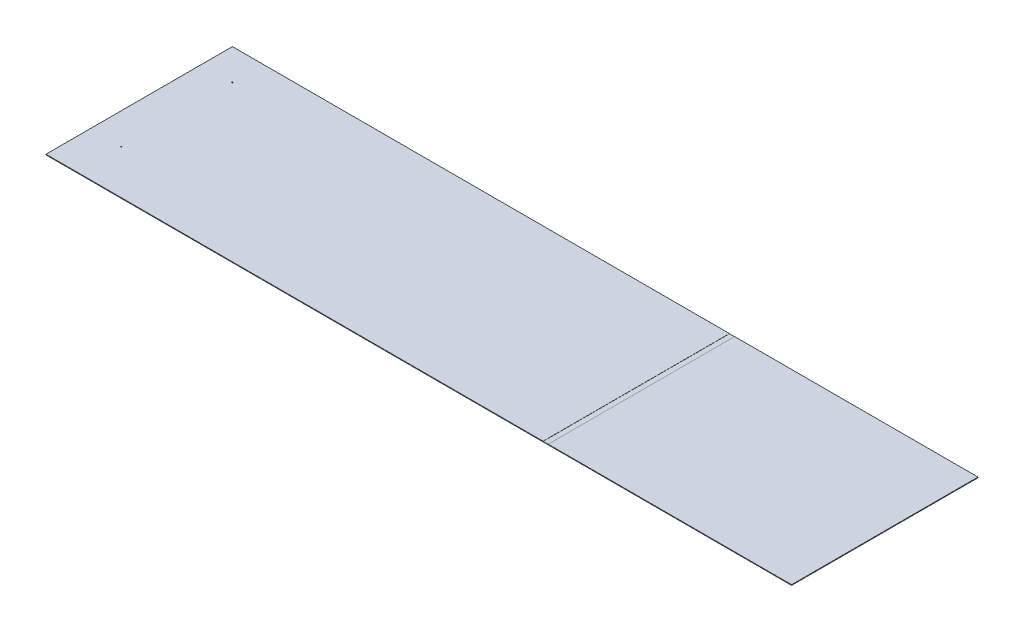
ISO-10303-21;
HEADER;
FILE_DESCRIPTION(('STEP AP214'),'2;1');
FILE_NAME('part.step','',(''),(''),'','','');
FILE_SCHEMA(('AUTOMOTIVE_DESIGN { 1 0 10303 214 1 1 1 1 }'));
ENDSEC;
DATA;
#1=APPLICATION_CONTEXT('core data for automotive mechanical design processes');
#2=APPLICATION_PROTOCOL_DEFINITION('international standard','automotive_design',2000,#1);
#3=PRODUCT_CONTEXT('',#1,'mechanical');
#4=PRODUCT('Part','Part','',(#3));
#5=PRODUCT_RELATED_PRODUCT_CATEGORY('part','',(#4));
#6=PRODUCT_DEFINITION_FORMATION('','',#4);
#7=PRODUCT_DEFINITION_CONTEXT('part definition',#1,'design');
#8=PRODUCT_DEFINITION('design','',#6,#7);
#9=PRODUCT_DEFINITION_SHAPE('','',#8);
#10=(LENGTH_UNIT() NAMED_UNIT(*) SI_UNIT(.MILLI.,.METRE.));
#11=(NAMED_UNIT(*) PLANE_ANGLE_UNIT() SI_UNIT($,.RADIAN.));
#12=(NAMED_UNIT(*) SI_UNIT($,.STERADIAN.) SOLID_ANGLE_UNIT());
#13=UNCERTAINTY_MEASURE_WITH_UNIT(LENGTH_MEASURE(1.E-05),#10,'distance_accuracy_value','');
#14=(GEOMETRIC_REPRESENTATION_CONTEXT(3) GLOBAL_UNCERTAINTY_ASSIGNED_CONTEXT((#13)) GLOBAL_UNIT_ASSIGNED_CONTEXT((#10,
#11,#12)) REPRESENTATION_CONTEXT('',''));
#15=CARTESIAN_POINT('',(0.,0.,0.));
#16=DIRECTION('',(0.,0.,1.));
#17=DIRECTION('',(1.,0.,0.));
#18=AXIS2_PLACEMENT_3D('',#15,#16,#17);
#19=CARTESIAN_POINT('',(0.,3.175,0.));
#20=DIRECTION('',(0.,1.,0.));
#21=DIRECTION('',(0.,0.,1.));
#22=AXIS2_PLACEMENT_3D('',#19,#20,#21);
#23=PLANE('',#22);
#24=DIRECTION('',(0.,0.,1.));
#25=VECTOR('',#24,1.);
#26=CARTESIAN_POINT('',(1029.72013969732,3.175,-803.692665890571));
#27=LINE('',#26,#25);
#28=CARTESIAN_POINT('',(1029.72013969732,3.175,-803.692665890571));
#29=VERTEX_POINT('',#28);
#30=CARTESIAN_POINT('',(1029.72013969732,3.175,110.707334109429));
#31=VERTEX_POINT('',#30);
#32=EDGE_CURVE('E121',#29,#31,#27,.T.);
#33=ORIENTED_EDGE('',*,*,#32,.F.);
#34=DIRECTION('',(-1.,0.,0.));
#35=VECTOR('',#34,1.);
#36=CARTESIAN_POINT('',(-1408.67986030268,3.175,-803.692665890571));
#37=LINE('',#36,#35);
#38=CARTESIAN_POINT('',(-1408.67986030268,3.175,-803.692665890571));
#39=VERTEX_POINT('',#38);
#40=EDGE_CURVE('E66',#29,#39,#37,.T.);
#41=ORIENTED_EDGE('',*,*,#40,.T.);
#42=DIRECTION('',(0.,0.,1.));
#43=VECTOR('',#42,1.);
#44=CARTESIAN_POINT('',(-1408.67986030268,3.175,-803.692665890571));
#45=LINE('',#44,#43);
#46=CARTESIAN_POINT('',(-1408.67986030268,3.175,110.707334109429));
#47=VERTEX_POINT('',#46);
#48=EDGE_CURVE('E176',#39,#47,#45,.T.);
#49=ORIENTED_EDGE('',*,*,#48,.T.);
#50=DIRECTION('',(1.,0.,0.));
#51=VECTOR('',#50,1.);
#52=CARTESIAN_POINT('',(-1408.67986030268,3.175,110.707334109429));
#53=LINE('',#52,#51);
#54=EDGE_CURVE('E95',#47,#31,#53,.T.);
#55=ORIENTED_EDGE('',*,*,#54,.T.);
#56=EDGE_LOOP('',(#33,#41,#49,#55));
#57=FACE_BOUND('',#56,.T.);
#58=CARTESIAN_POINT('',(-1256.27986030268,3.175,-651.292665890571));
#59=DIRECTION('',(0.,1.,0.));
#60=DIRECTION('',(0.,0.,1.));
#61=AXIS2_PLACEMENT_3D('',#58,#59,#60);
#62=CIRCLE('',#61,2.5796874999999);
#63=CARTESIAN_POINT('',(-1256.27986030268,3.175,-648.712978390571));
#64=VERTEX_POINT('',#63);
#65=EDGE_CURVE('E165',#64,#64,#62,.T.);
#66=ORIENTED_EDGE('',*,*,#65,.F.);
#67=EDGE_LOOP('',(#66));
#68=FACE_BOUND('',#67,.T.);
#69=CARTESIAN_POINT('',(-1256.27986030268,3.175,-105.192665890571));
#70=DIRECTION('',(0.,1.,0.));
#71=DIRECTION('',(0.,0.,1.));
#72=AXIS2_PLACEMENT_3D('',#69,#70,#71);
#73=CIRCLE('',#72,2.5796874999999);
#74=CARTESIAN_POINT('',(-1256.27986030268,3.175,-102.612978390571));
#75=VERTEX_POINT('',#74);
#76=EDGE_CURVE('E153',#75,#75,#73,.T.);
#77=ORIENTED_EDGE('',*,*,#76,.F.);
#78=EDGE_LOOP('',(#77));
#79=FACE_BOUND('',#78,.T.);
#80=ADVANCED_FACE('F41',(#57,#68,#79),#23,.T.);
#81=CARTESIAN_POINT('',(-1408.67986030268,3.175,-803.692665890571));
#82=DIRECTION('',(1.,0.,0.));
#83=DIRECTION('',(0.,0.,-1.));
#84=AXIS2_PLACEMENT_3D('',#81,#82,#83);
#85=PLANE('',#84);
#86=DIRECTION('',(0.,0.,1.));
#87=VECTOR('',#86,1.);
#88=CARTESIAN_POINT('',(-1408.67986030268,0.,-803.692665890571));
#89=LINE('',#88,#87);
#90=CARTESIAN_POINT('',(-1408.67986030268,0.,-803.692665890571));
#91=VERTEX_POINT('',#90);
#92=CARTESIAN_POINT('',(-1408.67986030268,0.,110.707334109429));
#93=VERTEX_POINT('',#92);
#94=EDGE_CURVE('E164',#91,#93,#89,.T.);
#95=ORIENTED_EDGE('',*,*,#94,.T.);
#96=DIRECTION('',(0.,-1.,0.));
#97=VECTOR('',#96,1.);
#98=CARTESIAN_POINT('',(-1408.67986030268,3.175,110.707334109429));
#99=LINE('',#98,#97);
#100=EDGE_CURVE('E11',#47,#93,#99,.T.);
#101=ORIENTED_EDGE('',*,*,#100,.F.);
#102=ORIENTED_EDGE('',*,*,#48,.F.);
#103=DIRECTION('',(0.,-1.,0.));
#104=VECTOR('',#103,1.);
#105=CARTESIAN_POINT('',(-1408.67986030268,3.175,-803.692665890571));
#106=LINE('',#105,#104);
#107=EDGE_CURVE('E189',#39,#91,#106,.T.);
#108=ORIENTED_EDGE('',*,*,#107,.T.);
#109=EDGE_LOOP('',(#95,#101,#102,#108));
#110=FACE_BOUND('',#109,.T.);
#111=ADVANCED_FACE('F43',(#110),#85,.F.);
#112=CARTESIAN_POINT('',(-1408.67986030268,3.175,110.707334109429));
#113=DIRECTION('',(0.,0.,-1.));
#114=DIRECTION('',(-1.,0.,0.));
#115=AXIS2_PLACEMENT_3D('',#112,#113,#114);
#116=PLANE('',#115);
#117=DIRECTION('',(1.,0.,0.));
#118=VECTOR('',#117,1.);
#119=CARTESIAN_POINT('',(1029.72013969732,2.38125,110.707334109429));
#120=LINE('',#119,#118);
#121=CARTESIAN_POINT('',(1029.72013969732,2.38125,110.707334109429));
#122=VERTEX_POINT('',#121);
#123=CARTESIAN_POINT('',(1055.12013969732,2.38125,110.707334109429));
#124=VERTEX_POINT('',#123);
#125=EDGE_CURVE('E130',#122,#124,#120,.T.);
#126=ORIENTED_EDGE('',*,*,#125,.F.);
#127=DIRECTION('',(0.,1.,0.));
#128=VECTOR('',#127,1.);
#129=CARTESIAN_POINT('',(1029.72013969732,2.38125,110.707334109429));
#130=LINE('',#129,#128);
#131=EDGE_CURVE('E116',#122,#31,#130,.T.);
#132=ORIENTED_EDGE('',*,*,#131,.T.);
#133=ORIENTED_EDGE('',*,*,#54,.F.);
#134=ORIENTED_EDGE('',*,*,#100,.T.);
#135=DIRECTION('',(1.,0.,0.));
#136=VECTOR('',#135,1.);
#137=CARTESIAN_POINT('',(-1408.67986030268,0.,110.707334109429));
#138=LINE('',#137,#136);
#139=CARTESIAN_POINT('',(2248.92013969732,0.,110.707334109429));
#140=VERTEX_POINT('',#139);
#141=EDGE_CURVE('E193',#93,#140,#138,.T.);
#142=ORIENTED_EDGE('',*,*,#141,.T.);
#143=DIRECTION('',(0.,-1.,0.));
#144=VECTOR('',#143,1.);
#145=CARTESIAN_POINT('',(2248.92013969732,3.175,110.707334109429));
#146=LINE('',#145,#144);
#147=CARTESIAN_POINT('',(2248.92013969732,3.175,110.707334109429));
#148=VERTEX_POINT('',#147);
#149=EDGE_CURVE('E50',#148,#140,#146,.T.);
#150=ORIENTED_EDGE('',*,*,#149,.F.);
#151=CARTESIAN_POINT('',(1055.12013969732,3.175,110.707334109429));
#152=VERTEX_POINT('',#151);
#153=EDGE_CURVE('E179',#152,#148,#53,.T.);
#154=ORIENTED_EDGE('',*,*,#153,.F.);
#155=DIRECTION('',(0.,1.,0.));
#156=VECTOR('',#155,1.);
#157=CARTESIAN_POINT('',(1055.12013969732,2.38125,110.707334109429));
#158=LINE('',#157,#156);
#159=EDGE_CURVE('E57',#124,#152,#158,.T.);
#160=ORIENTED_EDGE('',*,*,#159,.F.);
#161=EDGE_LOOP('',(#126,#132,#133,#134,#142,#150,#154,#160));
#162=FACE_BOUND('',#161,.T.);
#163=ADVANCED_FACE('F136',(#162),#116,.F.);
#164=CARTESIAN_POINT('',(2248.92013969732,3.175,-803.692665890571));
#165=DIRECTION('',(-1.,0.,0.));
#166=DIRECTION('',(0.,0.,1.));
#167=AXIS2_PLACEMENT_3D('',#164,#165,#166);
#168=PLANE('',#167);
#169=DIRECTION('',(0.,0.,-1.));
#170=VECTOR('',#169,1.);
#171=CARTESIAN_POINT('',(2248.92013969732,0.,-803.692665890571));
#172=LINE('',#171,#170);
#173=CARTESIAN_POINT('',(2248.92013969732,0.,-803.692665890571));
#174=VERTEX_POINT('',#173);
#175=EDGE_CURVE('E196',#140,#174,#172,.T.);
#176=ORIENTED_EDGE('',*,*,#175,.T.);
#177=DIRECTION('',(0.,-1.,0.));
#178=VECTOR('',#177,1.);
#179=CARTESIAN_POINT('',(2248.92013969732,3.175,-803.692665890571));
#180=LINE('',#179,#178);
#181=CARTESIAN_POINT('',(2248.92013969732,3.175,-803.692665890571));
#182=VERTEX_POINT('',#181);
#183=EDGE_CURVE('E203',#182,#174,#180,.T.);
#184=ORIENTED_EDGE('',*,*,#183,.F.);
#185=DIRECTION('',(0.,0.,-1.));
#186=VECTOR('',#185,1.);
#187=CARTESIAN_POINT('',(2248.92013969732,3.175,-803.692665890571));
#188=LINE('',#187,#186);
#189=EDGE_CURVE('E182',#148,#182,#188,.T.);
#190=ORIENTED_EDGE('',*,*,#189,.F.);
#191=ORIENTED_EDGE('',*,*,#149,.T.);
#192=EDGE_LOOP('',(#176,#184,#190,#191));
#193=FACE_BOUND('',#192,.T.);
#194=ADVANCED_FACE('F211',(#193),#168,.F.);
#195=CARTESIAN_POINT('',(-1408.67986030268,3.175,-803.692665890571));
#196=DIRECTION('',(0.,0.,1.));
#197=DIRECTION('',(1.,0.,0.));
#198=AXIS2_PLACEMENT_3D('',#195,#196,#197);
#199=PLANE('',#198);
#200=ORIENTED_EDGE('',*,*,#40,.F.);
#201=DIRECTION('',(0.,1.,0.));
#202=VECTOR('',#201,1.);
#203=CARTESIAN_POINT('',(1029.72013969732,2.38125,-803.692665890571));
#204=LINE('',#203,#202);
#205=CARTESIAN_POINT('',(1029.72013969732,2.38125,-803.692665890571));
#206=VERTEX_POINT('',#205);
#207=EDGE_CURVE('E150',#206,#29,#204,.T.);
#208=ORIENTED_EDGE('',*,*,#207,.F.);
#209=DIRECTION('',(-1.,0.,0.));
#210=VECTOR('',#209,1.);
#211=CARTESIAN_POINT('',(1029.72013969732,2.38125,-803.692665890571));
#212=LINE('',#211,#210);
#213=CARTESIAN_POINT('',(1055.12013969732,2.38125,-803.692665890571));
#214=VERTEX_POINT('',#213);
#215=EDGE_CURVE('E124',#214,#206,#212,.T.);
#216=ORIENTED_EDGE('',*,*,#215,.F.);
#217=DIRECTION('',(0.,1.,0.));
#218=VECTOR('',#217,1.);
#219=CARTESIAN_POINT('',(1055.12013969732,2.38125,-803.692665890571));
#220=LINE('',#219,#218);
#221=CARTESIAN_POINT('',(1055.12013969732,3.175,-803.692665890571));
#222=VERTEX_POINT('',#221);
#223=EDGE_CURVE('E154',#214,#222,#220,.T.);
#224=ORIENTED_EDGE('',*,*,#223,.T.);
#225=EDGE_CURVE('E185',#182,#222,#37,.T.);
#226=ORIENTED_EDGE('',*,*,#225,.F.);
#227=ORIENTED_EDGE('',*,*,#183,.T.);
#228=DIRECTION('',(-1.,0.,0.));
#229=VECTOR('',#228,1.);
#230=CARTESIAN_POINT('',(-1408.67986030268,0.,-803.692665890571));
#231=LINE('',#230,#229);
#232=EDGE_CURVE('E88',#174,#91,#231,.T.);
#233=ORIENTED_EDGE('',*,*,#232,.T.);
#234=ORIENTED_EDGE('',*,*,#107,.F.);
#235=EDGE_LOOP('',(#200,#208,#216,#224,#226,#227,#233,#234));
#236=FACE_BOUND('',#235,.T.);
#237=ADVANCED_FACE('F219',(#236),#199,.F.);
#238=DIRECTION('',(0.,0.,-1.));
#239=VECTOR('',#238,1.);
#240=CARTESIAN_POINT('',(1055.12013969732,3.175,-803.692665890571));
#241=LINE('',#240,#239);
#242=EDGE_CURVE('E134',#152,#222,#241,.T.);
#243=ORIENTED_EDGE('',*,*,#242,.F.);
#244=ORIENTED_EDGE('',*,*,#153,.T.);
#245=ORIENTED_EDGE('',*,*,#189,.T.);
#246=ORIENTED_EDGE('',*,*,#225,.T.);
#247=EDGE_LOOP('',(#243,#244,#245,#246));
#248=FACE_BOUND('',#247,.T.);
#249=ADVANCED_FACE('F223',(#248),#23,.T.);
#250=CARTESIAN_POINT('',(0.,0.,0.));
#251=DIRECTION('',(0.,1.,0.));
#252=DIRECTION('',(0.,0.,1.));
#253=AXIS2_PLACEMENT_3D('',#250,#251,#252);
#254=PLANE('',#253);
#255=CARTESIAN_POINT('',(-1256.27986030268,0.,-651.292665890571));
#256=DIRECTION('',(0.,1.,0.));
#257=DIRECTION('',(0.,0.,1.));
#258=AXIS2_PLACEMENT_3D('',#255,#256,#257);
#259=CIRCLE('',#258,2.5796874999999);
#260=CARTESIAN_POINT('',(-1256.27986030268,0.,-648.712978390571));
#261=VERTEX_POINT('',#260);
#262=EDGE_CURVE('E160',#261,#261,#259,.T.);
#263=ORIENTED_EDGE('',*,*,#262,.T.);
#264=EDGE_LOOP('',(#263));
#265=FACE_BOUND('',#264,.T.);
#266=CARTESIAN_POINT('',(-1256.27986030268,0.,-105.192665890571));
#267=DIRECTION('',(0.,1.,0.));
#268=DIRECTION('',(0.,0.,1.));
#269=AXIS2_PLACEMENT_3D('',#266,#267,#268);
#270=CIRCLE('',#269,2.5796874999999);
#271=CARTESIAN_POINT('',(-1256.27986030268,0.,-102.612978390571));
#272=VERTEX_POINT('',#271);
#273=EDGE_CURVE('E169',#272,#272,#270,.T.);
#274=ORIENTED_EDGE('',*,*,#273,.T.);
#275=EDGE_LOOP('',(#274));
#276=FACE_BOUND('',#275,.T.);
#277=ORIENTED_EDGE('',*,*,#94,.F.);
#278=ORIENTED_EDGE('',*,*,#232,.F.);
#279=ORIENTED_EDGE('',*,*,#175,.F.);
#280=ORIENTED_EDGE('',*,*,#141,.F.);
#281=EDGE_LOOP('',(#277,#278,#279,#280));
#282=FACE_BOUND('',#281,.T.);
#283=ADVANCED_FACE('F215',(#265,#276,#282),#254,.F.);
#284=CARTESIAN_POINT('',(-1256.27986030268,0.,-105.192665890571));
#285=DIRECTION('',(0.,1.,0.));
#286=DIRECTION('',(0.,0.,1.));
#287=AXIS2_PLACEMENT_3D('',#284,#285,#286);
#288=CYLINDRICAL_SURFACE('',#287,2.5796874999999);
#289=ORIENTED_EDGE('',*,*,#273,.F.);
#290=EDGE_LOOP('',(#289));
#291=FACE_BOUND('',#290,.T.);
#292=ORIENTED_EDGE('',*,*,#76,.T.);
#293=EDGE_LOOP('',(#292));
#294=FACE_BOUND('',#293,.T.);
#295=ADVANCED_FACE('F248',(#291,#294),#288,.F.);
#296=CARTESIAN_POINT('',(-1256.27986030268,0.,-651.292665890571));
#297=DIRECTION('',(0.,1.,0.));
#298=DIRECTION('',(0.,0.,1.));
#299=AXIS2_PLACEMENT_3D('',#296,#297,#298);
#300=CYLINDRICAL_SURFACE('',#299,2.5796874999999);
#301=ORIENTED_EDGE('',*,*,#262,.F.);
#302=EDGE_LOOP('',(#301));
#303=FACE_BOUND('',#302,.T.);
#304=ORIENTED_EDGE('',*,*,#65,.T.);
#305=EDGE_LOOP('',(#304));
#306=FACE_BOUND('',#305,.T.);
#307=ADVANCED_FACE('F233',(#303,#306),#300,.F.);
#308=CARTESIAN_POINT('',(1029.72013969732,2.38125,-803.692665890571));
#309=DIRECTION('',(-1.,0.,0.));
#310=DIRECTION('',(0.,0.,1.));
#311=AXIS2_PLACEMENT_3D('',#308,#309,#310);
#312=PLANE('',#311);
#313=ORIENTED_EDGE('',*,*,#32,.T.);
#314=ORIENTED_EDGE('',*,*,#131,.F.);
#315=DIRECTION('',(0.,0.,1.));
#316=VECTOR('',#315,1.);
#317=CARTESIAN_POINT('',(1029.72013969732,2.38125,-803.692665890571));
#318=LINE('',#317,#316);
#319=EDGE_CURVE('E119',#206,#122,#318,.T.);
#320=ORIENTED_EDGE('',*,*,#319,.F.);
#321=ORIENTED_EDGE('',*,*,#207,.T.);
#322=EDGE_LOOP('',(#313,#314,#320,#321));
#323=FACE_BOUND('',#322,.T.);
#324=ADVANCED_FACE('F118',(#323),#312,.F.);
#325=CARTESIAN_POINT('',(1055.12013969732,2.38125,-803.692665890571));
#326=DIRECTION('',(1.,0.,0.));
#327=DIRECTION('',(0.,0.,-1.));
#328=AXIS2_PLACEMENT_3D('',#325,#326,#327);
#329=PLANE('',#328);
#330=ORIENTED_EDGE('',*,*,#242,.T.);
#331=ORIENTED_EDGE('',*,*,#223,.F.);
#332=DIRECTION('',(0.,0.,-1.));
#333=VECTOR('',#332,1.);
#334=CARTESIAN_POINT('',(1055.12013969732,2.38125,-803.692665890571));
#335=LINE('',#334,#333);
#336=EDGE_CURVE('E139',#124,#214,#335,.T.);
#337=ORIENTED_EDGE('',*,*,#336,.F.);
#338=ORIENTED_EDGE('',*,*,#159,.T.);
#339=EDGE_LOOP('',(#330,#331,#337,#338));
#340=FACE_BOUND('',#339,.T.);
#341=ADVANCED_FACE('F225',(#340),#329,.F.);
#342=CARTESIAN_POINT('',(0.,2.38125,0.));
#343=DIRECTION('',(0.,1.,0.));
#344=DIRECTION('',(0.,0.,1.));
#345=AXIS2_PLACEMENT_3D('',#342,#343,#344);
#346=PLANE('',#345);
#347=ORIENTED_EDGE('',*,*,#319,.T.);
#348=ORIENTED_EDGE('',*,*,#125,.T.);
#349=ORIENTED_EDGE('',*,*,#336,.T.);
#350=ORIENTED_EDGE('',*,*,#215,.T.);
#351=EDGE_LOOP('',(#347,#348,#349,#350));
#352=FACE_BOUND('',#351,.T.);
#353=ADVANCED_FACE('F128',(#352),#346,.T.);
#354=CLOSED_SHELL('',(#80,#111,#163,#194,#237,#249,#283,#295,#307,#324,#341,#353));
#355=MANIFOLD_SOLID_BREP('B2',#354);
#356=ADVANCED_BREP_SHAPE_REPRESENTATION('',(#18,#355),#14);
#357=SHAPE_DEFINITION_REPRESENTATION(#9,#356);
ENDSEC;
END-ISO-10303-21;
